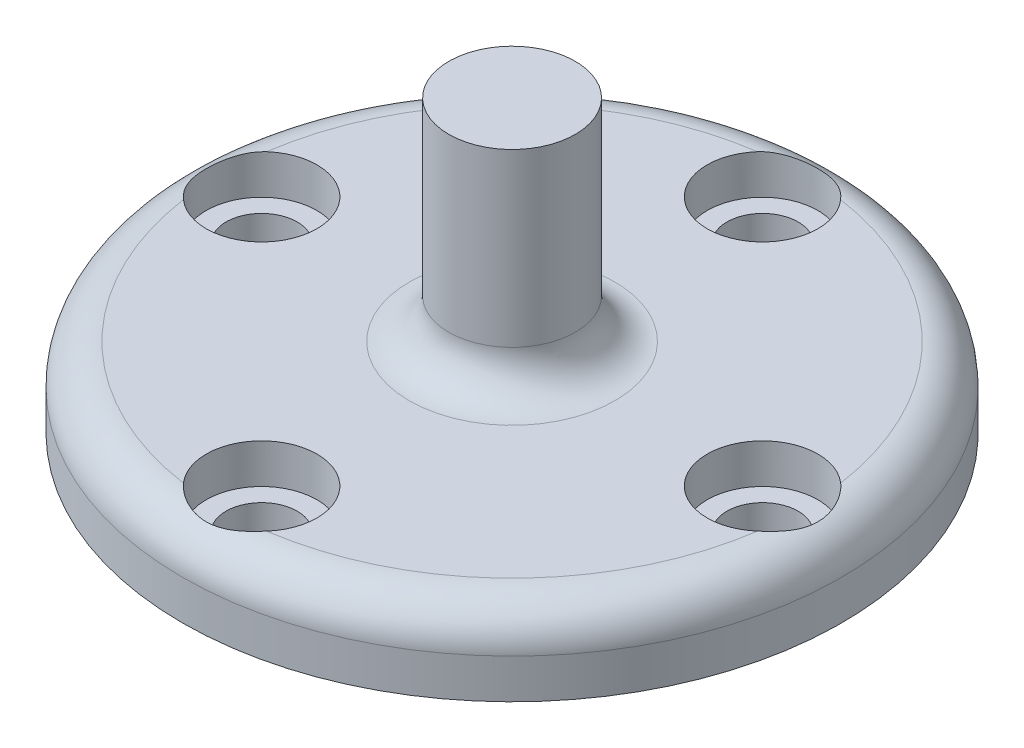
ISO-10303-21;
HEADER;
FILE_DESCRIPTION(('STEP AP214'),'2;1');
FILE_NAME('part.step','',(''),(''),'','','');
FILE_SCHEMA(('AUTOMOTIVE_DESIGN { 1 0 10303 214 1 1 1 1 }'));
ENDSEC;
DATA;
#1=APPLICATION_CONTEXT('core data for automotive mechanical design processes');
#2=APPLICATION_PROTOCOL_DEFINITION('international standard','automotive_design',2000,#1);
#3=PRODUCT_CONTEXT('',#1,'mechanical');
#4=PRODUCT('Part','Part','',(#3));
#5=PRODUCT_RELATED_PRODUCT_CATEGORY('part','',(#4));
#6=PRODUCT_DEFINITION_FORMATION('','',#4);
#7=PRODUCT_DEFINITION_CONTEXT('part definition',#1,'design');
#8=PRODUCT_DEFINITION('design','',#6,#7);
#9=PRODUCT_DEFINITION_SHAPE('','',#8);
#10=(LENGTH_UNIT() NAMED_UNIT(*) SI_UNIT(.MILLI.,.METRE.));
#11=(NAMED_UNIT(*) PLANE_ANGLE_UNIT() SI_UNIT($,.RADIAN.));
#12=(NAMED_UNIT(*) SI_UNIT($,.STERADIAN.) SOLID_ANGLE_UNIT());
#13=UNCERTAINTY_MEASURE_WITH_UNIT(LENGTH_MEASURE(1.E-05),#10,'distance_accuracy_value','');
#14=(GEOMETRIC_REPRESENTATION_CONTEXT(3) GLOBAL_UNCERTAINTY_ASSIGNED_CONTEXT((#13)) GLOBAL_UNIT_ASSIGNED_CONTEXT((#10,
#11,#12)) REPRESENTATION_CONTEXT('',''));
#15=CARTESIAN_POINT('',(0.,0.,0.));
#16=DIRECTION('',(0.,0.,1.));
#17=DIRECTION('',(1.,0.,0.));
#18=AXIS2_PLACEMENT_3D('',#15,#16,#17);
#19=CARTESIAN_POINT('',(0.,0.,-9.5));
#20=DIRECTION('',(0.,1.,0.));
#21=DIRECTION('',(0.,0.,1.));
#22=AXIS2_PLACEMENT_3D('',#19,#20,#21);
#23=CYLINDRICAL_SURFACE('',#22,1.35);
#24=CARTESIAN_POINT('',(0.,0.,-9.5));
#25=DIRECTION('',(0.,1.,0.));
#26=DIRECTION('',(0.,0.,1.));
#27=AXIS2_PLACEMENT_3D('',#24,#25,#26);
#28=CIRCLE('',#27,1.35);
#29=CARTESIAN_POINT('',(0.,0.,-8.15));
#30=VERTEX_POINT('',#29);
#31=EDGE_CURVE('E201',#30,#30,#28,.T.);
#32=ORIENTED_EDGE('',*,*,#31,.F.);
#33=EDGE_LOOP('',(#32));
#34=FACE_BOUND('',#33,.T.);
#35=CARTESIAN_POINT('',(0.,1.5,-9.5));
#36=DIRECTION('',(0.,1.,0.));
#37=DIRECTION('',(0.,0.,1.));
#38=AXIS2_PLACEMENT_3D('',#35,#36,#37);
#39=CIRCLE('',#38,1.35);
#40=CARTESIAN_POINT('',(0.,1.5,-8.15));
#41=VERTEX_POINT('',#40);
#42=EDGE_CURVE('E210',#41,#41,#39,.F.);
#43=ORIENTED_EDGE('',*,*,#42,.F.);
#44=EDGE_LOOP('',(#43));
#45=FACE_BOUND('',#44,.T.);
#46=ADVANCED_FACE('F43',(#34,#45),#23,.F.);
#47=CARTESIAN_POINT('',(0.,3.,0.));
#48=DIRECTION('',(0.,-1.,0.));
#49=DIRECTION('',(0.,0.,-1.));
#50=AXIS2_PLACEMENT_3D('',#47,#48,#49);
#51=CYLINDRICAL_SURFACE('',#50,12.5);
#52=CARTESIAN_POINT('',(0.,1.5,0.));
#53=DIRECTION('',(0.,1.,0.));
#54=DIRECTION('',(0.,0.,1.));
#55=AXIS2_PLACEMENT_3D('',#52,#53,#54);
#56=CIRCLE('',#55,12.5);
#57=CARTESIAN_POINT('',(0.,1.5,12.5));
#58=VERTEX_POINT('',#57);
#59=EDGE_CURVE('E52',#58,#58,#56,.F.);
#60=ORIENTED_EDGE('',*,*,#59,.T.);
#61=EDGE_LOOP('',(#60));
#62=FACE_BOUND('',#61,.T.);
#63=CARTESIAN_POINT('',(0.,0.,0.));
#64=DIRECTION('',(0.,1.,0.));
#65=DIRECTION('',(0.,0.,1.));
#66=AXIS2_PLACEMENT_3D('',#63,#64,#65);
#67=CIRCLE('',#66,12.5);
#68=CARTESIAN_POINT('',(0.,0.,12.5));
#69=VERTEX_POINT('',#68);
#70=EDGE_CURVE('E198',#69,#69,#67,.T.);
#71=ORIENTED_EDGE('',*,*,#70,.T.);
#72=EDGE_LOOP('',(#71));
#73=FACE_BOUND('',#72,.T.);
#74=ADVANCED_FACE('F182',(#62,#73),#51,.T.);
#75=CARTESIAN_POINT('',(0.,3.,0.));
#76=DIRECTION('',(0.,1.,0.));
#77=DIRECTION('',(0.,0.,1.));
#78=AXIS2_PLACEMENT_3D('',#75,#76,#77);
#79=PLANE('',#78);
#80=CARTESIAN_POINT('',(0.,3.,0.));
#81=DIRECTION('',(0.,1.,0.));
#82=DIRECTION('',(0.,0.,1.));
#83=AXIS2_PLACEMENT_3D('',#80,#81,#82);
#84=CIRCLE('',#83,3.9);
#85=CARTESIAN_POINT('',(0.,3.,3.9));
#86=VERTEX_POINT('',#85);
#87=EDGE_CURVE('E96',#86,#86,#84,.F.);
#88=ORIENTED_EDGE('',*,*,#87,.T.);
#89=EDGE_LOOP('',(#88));
#90=FACE_BOUND('',#89,.T.);
#91=CARTESIAN_POINT('',(9.5,3.,0.));
#92=DIRECTION('',(0.,1.,0.));
#93=DIRECTION('',(-1.,0.,0.));
#94=AXIS2_PLACEMENT_3D('',#91,#92,#93);
#95=CIRCLE('',#94,2.1);
#96=CARTESIAN_POINT('',(10.8863157894737,3.,-1.57738027496727));
#97=VERTEX_POINT('',#96);
#98=CARTESIAN_POINT('',(10.8863157894737,3.,1.57738027496735));
#99=VERTEX_POINT('',#98);
#100=EDGE_CURVE('E89',#97,#99,#95,.T.);
#101=ORIENTED_EDGE('',*,*,#100,.F.);
#102=CARTESIAN_POINT('',(0.,3.,0.));
#103=DIRECTION('',(0.,1.,0.));
#104=DIRECTION('',(0.,0.,1.));
#105=AXIS2_PLACEMENT_3D('',#102,#103,#104);
#106=CIRCLE('',#105,11.);
#107=CARTESIAN_POINT('',(1.57738027496731,3.,-10.8863157894737));
#108=VERTEX_POINT('',#107);
#109=EDGE_CURVE('E106',#97,#108,#106,.T.);
#110=ORIENTED_EDGE('',*,*,#109,.T.);
#111=CARTESIAN_POINT('',(0.,3.,-9.5));
#112=DIRECTION('',(0.,1.,0.));
#113=DIRECTION('',(0.,0.,1.));
#114=AXIS2_PLACEMENT_3D('',#111,#112,#113);
#115=CIRCLE('',#114,2.1);
#116=CARTESIAN_POINT('',(-1.57738027496731,3.,-10.8863157894737));
#117=VERTEX_POINT('',#116);
#118=EDGE_CURVE('E224',#117,#108,#115,.T.);
#119=ORIENTED_EDGE('',*,*,#118,.F.);
#120=CARTESIAN_POINT('',(0.,3.,0.));
#121=DIRECTION('',(0.,1.,0.));
#122=DIRECTION('',(0.,0.,1.));
#123=AXIS2_PLACEMENT_3D('',#120,#121,#122);
#124=CIRCLE('',#123,11.);
#125=CARTESIAN_POINT('',(-10.8863157894737,3.,-1.57738027496743));
#126=VERTEX_POINT('',#125);
#127=EDGE_CURVE('E219',#117,#126,#124,.T.);
#128=ORIENTED_EDGE('',*,*,#127,.T.);
#129=CARTESIAN_POINT('',(-9.5,3.,0.));
#130=DIRECTION('',(0.,1.,0.));
#131=DIRECTION('',(1.,0.,0.));
#132=AXIS2_PLACEMENT_3D('',#129,#130,#131);
#133=CIRCLE('',#132,2.1);
#134=CARTESIAN_POINT('',(-10.8863157894737,3.,1.5773802749672));
#135=VERTEX_POINT('',#134);
#136=EDGE_CURVE('E256',#135,#126,#133,.T.);
#137=ORIENTED_EDGE('',*,*,#136,.F.);
#138=CARTESIAN_POINT('',(0.,3.,0.));
#139=DIRECTION('',(0.,1.,0.));
#140=DIRECTION('',(0.,0.,1.));
#141=AXIS2_PLACEMENT_3D('',#138,#139,#140);
#142=CIRCLE('',#141,11.);
#143=CARTESIAN_POINT('',(-1.57738027496731,3.,10.8863157894737));
#144=VERTEX_POINT('',#143);
#145=EDGE_CURVE('E95',#135,#144,#142,.T.);
#146=ORIENTED_EDGE('',*,*,#145,.T.);
#147=CARTESIAN_POINT('',(0.,3.,9.5));
#148=DIRECTION('',(0.,1.,0.));
#149=DIRECTION('',(0.,0.,-1.));
#150=AXIS2_PLACEMENT_3D('',#147,#148,#149);
#151=CIRCLE('',#150,2.1);
#152=CARTESIAN_POINT('',(1.57738027496731,3.,10.8863157894737));
#153=VERTEX_POINT('',#152);
#154=EDGE_CURVE('E91',#153,#144,#151,.T.);
#155=ORIENTED_EDGE('',*,*,#154,.F.);
#156=CARTESIAN_POINT('',(0.,3.,0.));
#157=DIRECTION('',(0.,1.,0.));
#158=DIRECTION('',(0.,0.,1.));
#159=AXIS2_PLACEMENT_3D('',#156,#157,#158);
#160=CIRCLE('',#159,11.);
#161=EDGE_CURVE('E86',#153,#99,#160,.T.);
#162=ORIENTED_EDGE('',*,*,#161,.T.);
#163=EDGE_LOOP('',(#101,#110,#119,#128,#137,#146,#155,#162));
#164=FACE_BOUND('',#163,.T.);
#165=ADVANCED_FACE('F88',(#90,#164),#79,.T.);
#166=CARTESIAN_POINT('',(0.,0.,0.));
#167=DIRECTION('',(0.,1.,0.));
#168=DIRECTION('',(0.,0.,1.));
#169=AXIS2_PLACEMENT_3D('',#166,#167,#168);
#170=PLANE('',#169);
#171=CARTESIAN_POINT('',(9.5,0.,0.));
#172=DIRECTION('',(0.,1.,0.));
#173=DIRECTION('',(-1.,0.,0.));
#174=AXIS2_PLACEMENT_3D('',#171,#172,#173);
#175=CIRCLE('',#174,1.35);
#176=CARTESIAN_POINT('',(8.15,0.,0.));
#177=VERTEX_POINT('',#176);
#178=EDGE_CURVE('E226',#177,#177,#175,.T.);
#179=ORIENTED_EDGE('',*,*,#178,.T.);
#180=EDGE_LOOP('',(#179));
#181=FACE_BOUND('',#180,.T.);
#182=CARTESIAN_POINT('',(0.,0.,9.5));
#183=DIRECTION('',(0.,1.,0.));
#184=DIRECTION('',(0.,0.,-1.));
#185=AXIS2_PLACEMENT_3D('',#182,#183,#184);
#186=CIRCLE('',#185,1.35);
#187=CARTESIAN_POINT('',(0.,0.,8.15));
#188=VERTEX_POINT('',#187);
#189=EDGE_CURVE('E232',#188,#188,#186,.T.);
#190=ORIENTED_EDGE('',*,*,#189,.T.);
#191=EDGE_LOOP('',(#190));
#192=FACE_BOUND('',#191,.T.);
#193=CARTESIAN_POINT('',(-9.5,0.,0.));
#194=DIRECTION('',(0.,1.,0.));
#195=DIRECTION('',(1.,0.,0.));
#196=AXIS2_PLACEMENT_3D('',#193,#194,#195);
#197=CIRCLE('',#196,1.35);
#198=CARTESIAN_POINT('',(-8.15,0.,0.));
#199=VERTEX_POINT('',#198);
#200=EDGE_CURVE('E235',#199,#199,#197,.T.);
#201=ORIENTED_EDGE('',*,*,#200,.T.);
#202=EDGE_LOOP('',(#201));
#203=FACE_BOUND('',#202,.T.);
#204=ORIENTED_EDGE('',*,*,#31,.T.);
#205=EDGE_LOOP('',(#204));
#206=FACE_BOUND('',#205,.T.);
#207=ORIENTED_EDGE('',*,*,#70,.F.);
#208=EDGE_LOOP('',(#207));
#209=FACE_BOUND('',#208,.T.);
#210=ADVANCED_FACE('F186',(#181,#192,#203,#206,#209),#170,.F.);
#211=CARTESIAN_POINT('',(0.,1.5,-9.5));
#212=DIRECTION('',(0.,1.,0.));
#213=DIRECTION('',(0.,0.,1.));
#214=AXIS2_PLACEMENT_3D('',#211,#212,#213);
#215=PLANE('',#214);
#216=CARTESIAN_POINT('',(0.,1.5,-9.5));
#217=DIRECTION('',(0.,1.,0.));
#218=DIRECTION('',(0.,0.,1.));
#219=AXIS2_PLACEMENT_3D('',#216,#217,#218);
#220=CIRCLE('',#219,2.1);
#221=CARTESIAN_POINT('',(0.,1.5,-7.4));
#222=VERTEX_POINT('',#221);
#223=EDGE_CURVE('E216',#222,#222,#220,.T.);
#224=ORIENTED_EDGE('',*,*,#223,.T.);
#225=EDGE_LOOP('',(#224));
#226=FACE_BOUND('',#225,.T.);
#227=ORIENTED_EDGE('',*,*,#42,.T.);
#228=EDGE_LOOP('',(#227));
#229=FACE_BOUND('',#228,.T.);
#230=ADVANCED_FACE('F177',(#226,#229),#215,.T.);
#231=CARTESIAN_POINT('',(0.,1.5,-9.5));
#232=DIRECTION('',(0.,1.,0.));
#233=DIRECTION('',(0.,0.,1.));
#234=AXIS2_PLACEMENT_3D('',#231,#232,#233);
#235=CYLINDRICAL_SURFACE('',#234,2.1);
#236=ORIENTED_EDGE('',*,*,#223,.F.);
#237=EDGE_LOOP('',(#236));
#238=FACE_BOUND('',#237,.T.);
#239=ORIENTED_EDGE('',*,*,#118,.T.);
#240=CARTESIAN_POINT('',(1.57738027496731,3.,-10.8863157894737));
#241=CARTESIAN_POINT('',(1.5349891041414,2.99998857657452,-10.9345653348639));
#242=CARTESIAN_POINT('',(1.49039993461807,2.99826453872729,-10.9808213903737));
#243=CARTESIAN_POINT('',(1.39731034725975,2.99227485033015,-11.0689539051379));
#244=CARTESIAN_POINT('',(1.348813517057,2.9880115086396,-11.1108343023446));
#245=CARTESIAN_POINT('',(1.24839801387459,2.97783204704433,-11.1898462735401));
#246=CARTESIAN_POINT('',(1.196485142123,2.97191867660506,-11.2269855988685));
#247=CARTESIAN_POINT('',(1.08958513213709,2.95922649919493,-11.2963484332717));
#248=CARTESIAN_POINT('',(1.03459761760926,2.9524475861628,-11.3285713388377));
#249=CARTESIAN_POINT('',(0.878692009023795,2.93351622935145,-11.4106386218583));
#250=CARTESIAN_POINT('',(0.774867187980858,2.92122677816197,-11.4550642518468));
#251=CARTESIAN_POINT('',(0.561231662710039,2.89982550793822,-11.5267493873391));
#252=CARTESIAN_POINT('',(0.451424674417548,2.89071174171478,-11.554019420186));
#253=CARTESIAN_POINT('',(0.224102357027013,2.87796479914777,-11.5913009973022));
#254=CARTESIAN_POINT('',(0.106453598222821,2.87456049017974,-11.6005940304726));
#255=CARTESIAN_POINT('',(-0.12872752924703,2.87500603704746,-11.5993469062552));
#256=CARTESIAN_POINT('',(-0.246259894930211,2.87885607419162,-11.5888062531625));
#257=CARTESIAN_POINT('',(-0.471764062141029,2.89226071158382,-11.5493664572928));
#258=CARTESIAN_POINT('',(-0.579920949483285,2.90152298161669,-11.5214035473141));
#259=CARTESIAN_POINT('',(-0.790260741589626,2.92297520829711,-11.4488108207754));
#260=CARTESIAN_POINT('',(-0.892440887149015,2.93516650409049,-11.4041733754506));
#261=CARTESIAN_POINT('',(-1.04555654563005,2.9537920690025,-11.3222874329257));
#262=CARTESIAN_POINT('',(-1.0993710411016,2.96041378279082,-11.2903357309091));
#263=CARTESIAN_POINT('',(-1.20401363385988,2.97278246656713,-11.2217034260519));
#264=CARTESIAN_POINT('',(-1.25484210705593,2.97852954680793,-11.1850234203209));
#265=CARTESIAN_POINT('',(-1.35320163381201,2.98840674782049,-11.1071047435153));
#266=CARTESIAN_POINT('',(-1.40072676949992,2.99253402521057,-11.0658582176576));
#267=CARTESIAN_POINT('',(-1.49200364144476,2.99832643888071,-10.9791558697687));
#268=CARTESIAN_POINT('',(-1.53575200468445,2.99998939527897,-10.9336963587447));
#269=CARTESIAN_POINT('',(-1.57738027496731,3.00000000000001,-10.8863157894737));
#270=B_SPLINE_CURVE_WITH_KNOTS('',3,(#240,#241,#242,#243,#244,#245,#246,#247,#248,#249,#250,
#251,#252,#253,#254,#255,#256,#257,#258,#259,#260,#261,#262,#263,#264,#265,#266,#267,#268,#269),
.UNSPECIFIED.,.F.,.F.,(4,2,2,2,2,2,2,2,2,2,2,2,2,2,4),(0.,0.19252195179426,0.38486911986169,
0.57689767179495,0.768949777012993,1.1081731375737,1.44718813389067,1.79949381359815,
2.15180829862504,2.4866530688013,2.82165122177021,3.01024038194402,3.1988057495926,
3.387700657661,3.57676255829637),.UNSPECIFIED.);
#271=EDGE_CURVE('E58',#108,#117,#270,.T.);
#272=ORIENTED_EDGE('',*,*,#271,.T.);
#273=EDGE_LOOP('',(#239,#272));
#274=FACE_BOUND('',#273,.T.);
#275=ADVANCED_FACE('F171',(#238,#274),#235,.F.);
#276=CARTESIAN_POINT('',(-9.5,0.,0.));
#277=DIRECTION('',(0.,1.,0.));
#278=DIRECTION('',(1.,0.,0.));
#279=AXIS2_PLACEMENT_3D('',#276,#277,#278);
#280=CYLINDRICAL_SURFACE('',#279,1.35);
#281=ORIENTED_EDGE('',*,*,#200,.F.);
#282=EDGE_LOOP('',(#281));
#283=FACE_BOUND('',#282,.T.);
#284=CARTESIAN_POINT('',(-9.5,1.5,0.));
#285=DIRECTION('',(0.,1.,0.));
#286=DIRECTION('',(0.,0.,1.));
#287=AXIS2_PLACEMENT_3D('',#284,#285,#286);
#288=CIRCLE('',#287,1.35);
#289=CARTESIAN_POINT('',(-9.5,1.5,1.3499999999999));
#290=VERTEX_POINT('',#289);
#291=EDGE_CURVE('E239',#290,#290,#288,.F.);
#292=ORIENTED_EDGE('',*,*,#291,.F.);
#293=EDGE_LOOP('',(#292));
#294=FACE_BOUND('',#293,.T.);
#295=ADVANCED_FACE('F176',(#283,#294),#280,.F.);
#296=CARTESIAN_POINT('',(0.,0.,9.5));
#297=DIRECTION('',(0.,1.,0.));
#298=DIRECTION('',(0.,0.,-1.));
#299=AXIS2_PLACEMENT_3D('',#296,#297,#298);
#300=CYLINDRICAL_SURFACE('',#299,1.35);
#301=ORIENTED_EDGE('',*,*,#189,.F.);
#302=EDGE_LOOP('',(#301));
#303=FACE_BOUND('',#302,.T.);
#304=CARTESIAN_POINT('',(0.,1.5,9.5));
#305=DIRECTION('',(0.,1.,0.));
#306=DIRECTION('',(0.,0.,1.));
#307=AXIS2_PLACEMENT_3D('',#304,#305,#306);
#308=CIRCLE('',#307,1.35);
#309=CARTESIAN_POINT('',(0.,1.5,10.85));
#310=VERTEX_POINT('',#309);
#311=EDGE_CURVE('E246',#310,#310,#308,.F.);
#312=ORIENTED_EDGE('',*,*,#311,.F.);
#313=EDGE_LOOP('',(#312));
#314=FACE_BOUND('',#313,.T.);
#315=ADVANCED_FACE('F335',(#303,#314),#300,.F.);
#316=CARTESIAN_POINT('',(9.5,0.,0.));
#317=DIRECTION('',(0.,1.,0.));
#318=DIRECTION('',(-1.,0.,0.));
#319=AXIS2_PLACEMENT_3D('',#316,#317,#318);
#320=CYLINDRICAL_SURFACE('',#319,1.35);
#321=ORIENTED_EDGE('',*,*,#178,.F.);
#322=EDGE_LOOP('',(#321));
#323=FACE_BOUND('',#322,.T.);
#324=CARTESIAN_POINT('',(9.5,1.5,0.));
#325=DIRECTION('',(0.,1.,0.));
#326=DIRECTION('',(0.,0.,1.));
#327=AXIS2_PLACEMENT_3D('',#324,#325,#326);
#328=CIRCLE('',#327,1.35);
#329=CARTESIAN_POINT('',(9.5,1.5,1.35000000000003));
#330=VERTEX_POINT('',#329);
#331=EDGE_CURVE('E249',#330,#330,#328,.F.);
#332=ORIENTED_EDGE('',*,*,#331,.F.);
#333=EDGE_LOOP('',(#332));
#334=FACE_BOUND('',#333,.T.);
#335=ADVANCED_FACE('F140',(#323,#334),#320,.F.);
#336=CARTESIAN_POINT('',(9.5,1.5,0.));
#337=DIRECTION('',(0.,1.,0.));
#338=DIRECTION('',(-1.,0.,0.));
#339=AXIS2_PLACEMENT_3D('',#336,#337,#338);
#340=PLANE('',#339);
#341=CARTESIAN_POINT('',(9.5,1.5,0.));
#342=DIRECTION('',(0.,1.,0.));
#343=DIRECTION('',(-1.,0.,0.));
#344=AXIS2_PLACEMENT_3D('',#341,#342,#343);
#345=CIRCLE('',#344,2.1);
#346=CARTESIAN_POINT('',(7.4,1.5,0.));
#347=VERTEX_POINT('',#346);
#348=EDGE_CURVE('E102',#347,#347,#345,.T.);
#349=ORIENTED_EDGE('',*,*,#348,.T.);
#350=EDGE_LOOP('',(#349));
#351=FACE_BOUND('',#350,.T.);
#352=ORIENTED_EDGE('',*,*,#331,.T.);
#353=EDGE_LOOP('',(#352));
#354=FACE_BOUND('',#353,.T.);
#355=ADVANCED_FACE('F135',(#351,#354),#340,.T.);
#356=CARTESIAN_POINT('',(9.5,1.5,0.));
#357=DIRECTION('',(0.,1.,0.));
#358=DIRECTION('',(-1.,0.,0.));
#359=AXIS2_PLACEMENT_3D('',#356,#357,#358);
#360=CYLINDRICAL_SURFACE('',#359,2.1);
#361=ORIENTED_EDGE('',*,*,#348,.F.);
#362=EDGE_LOOP('',(#361));
#363=FACE_BOUND('',#362,.T.);
#364=ORIENTED_EDGE('',*,*,#100,.T.);
#365=CARTESIAN_POINT('',(10.8863157894737,3.,1.57738027496735));
#366=CARTESIAN_POINT('',(10.9345653348639,2.99998857657452,1.53498910414144));
#367=CARTESIAN_POINT('',(10.9808213903737,2.99826453872729,1.49039993461811));
#368=CARTESIAN_POINT('',(11.0689539051379,2.99227485033015,1.39731034725979));
#369=CARTESIAN_POINT('',(11.1108343023446,2.9880115086396,1.34881351705703));
#370=CARTESIAN_POINT('',(11.1898462735401,2.97783204704433,1.24839801387463));
#371=CARTESIAN_POINT('',(11.2269855988685,2.97191867660506,1.19648514212304));
#372=CARTESIAN_POINT('',(11.2963484332717,2.95922649919493,1.08958513213713));
#373=CARTESIAN_POINT('',(11.3285713388377,2.9524475861628,1.0345976176093));
#374=CARTESIAN_POINT('',(11.4106386218583,2.93351622935145,0.878692009023835));
#375=CARTESIAN_POINT('',(11.4550642518468,2.92122677816197,0.774867187980898));
#376=CARTESIAN_POINT('',(11.5267493873391,2.89982550793822,0.56123166271008));
#377=CARTESIAN_POINT('',(11.554019420186,2.89071174171479,0.451424674417589));
#378=CARTESIAN_POINT('',(11.5913009973022,2.87796479914777,0.224102357027054));
#379=CARTESIAN_POINT('',(11.6005940304726,2.87456049017974,0.106453598222862));
#380=CARTESIAN_POINT('',(11.5993469062552,2.87500603704746,-0.12872752924699));
#381=CARTESIAN_POINT('',(11.5888062531625,2.87885607419162,-0.246259894930171));
#382=CARTESIAN_POINT('',(11.5493664572928,2.89226071158382,-0.471764062140989));
#383=CARTESIAN_POINT('',(11.5214035473141,2.90152298161669,-0.579920949483245));
#384=CARTESIAN_POINT('',(11.4488108207754,2.92297520829711,-0.790260741589586));
#385=CARTESIAN_POINT('',(11.4041733754506,2.93516650409049,-0.892440887148974));
#386=CARTESIAN_POINT('',(11.3222874329257,2.9537920690025,-1.04555654563001));
#387=CARTESIAN_POINT('',(11.2903357309091,2.96041378279082,-1.09937104110156));
#388=CARTESIAN_POINT('',(11.2217034260519,2.97278246656713,-1.20401363385984));
#389=CARTESIAN_POINT('',(11.1850234203209,2.97852954680793,-1.25484210705589));
#390=CARTESIAN_POINT('',(11.1071047435153,2.98840674782049,-1.35320163381197));
#391=CARTESIAN_POINT('',(11.0658582176576,2.99253402521057,-1.40072676949988));
#392=CARTESIAN_POINT('',(10.9791558697687,2.99832643888071,-1.49200364144472));
#393=CARTESIAN_POINT('',(10.9336963587447,2.99998939527897,-1.53575200468441));
#394=CARTESIAN_POINT('',(10.8863157894737,3.00000000000001,-1.57738027496727));
#395=B_SPLINE_CURVE_WITH_KNOTS('',3,(#365,#366,#367,#368,#369,#370,#371,#372,#373,#374,#375,
#376,#377,#378,#379,#380,#381,#382,#383,#384,#385,#386,#387,#388,#389,#390,#391,#392,#393,#394),
.UNSPECIFIED.,.F.,.F.,(4,2,2,2,2,2,2,2,2,2,2,2,2,2,4),(0.,0.192521951794259,0.384869119861689,
0.576897671794947,0.768949777012992,1.1081731375737,1.44718813389067,1.79949381359815,
2.15180829862504,2.4866530688013,2.82165122177021,3.01024038194402,3.1988057495926,
3.38770065766099,3.57676255829637),.UNSPECIFIED.);
#396=EDGE_CURVE('E100',#99,#97,#395,.T.);
#397=ORIENTED_EDGE('',*,*,#396,.T.);
#398=EDGE_LOOP('',(#364,#397));
#399=FACE_BOUND('',#398,.T.);
#400=ADVANCED_FACE('F99',(#363,#399),#360,.F.);
#401=CARTESIAN_POINT('',(0.,1.5,9.5));
#402=DIRECTION('',(0.,1.,0.));
#403=DIRECTION('',(0.,0.,-1.));
#404=AXIS2_PLACEMENT_3D('',#401,#402,#403);
#405=PLANE('',#404);
#406=CARTESIAN_POINT('',(0.,1.5,9.5));
#407=DIRECTION('',(0.,1.,0.));
#408=DIRECTION('',(0.,0.,-1.));
#409=AXIS2_PLACEMENT_3D('',#406,#407,#408);
#410=CIRCLE('',#409,2.1);
#411=CARTESIAN_POINT('',(0.,1.5,7.4));
#412=VERTEX_POINT('',#411);
#413=EDGE_CURVE('E103',#412,#412,#410,.T.);
#414=ORIENTED_EDGE('',*,*,#413,.T.);
#415=EDGE_LOOP('',(#414));
#416=FACE_BOUND('',#415,.T.);
#417=ORIENTED_EDGE('',*,*,#311,.T.);
#418=EDGE_LOOP('',(#417));
#419=FACE_BOUND('',#418,.T.);
#420=ADVANCED_FACE('F134',(#416,#419),#405,.T.);
#421=CARTESIAN_POINT('',(0.,1.5,9.5));
#422=DIRECTION('',(0.,1.,0.));
#423=DIRECTION('',(0.,0.,-1.));
#424=AXIS2_PLACEMENT_3D('',#421,#422,#423);
#425=CYLINDRICAL_SURFACE('',#424,2.1);
#426=ORIENTED_EDGE('',*,*,#413,.F.);
#427=EDGE_LOOP('',(#426));
#428=FACE_BOUND('',#427,.T.);
#429=ORIENTED_EDGE('',*,*,#154,.T.);
#430=CARTESIAN_POINT('',(-1.57738027496731,3.,10.8863157894737));
#431=CARTESIAN_POINT('',(-1.5349891041414,2.99998857657452,10.9345653348639));
#432=CARTESIAN_POINT('',(-1.49039993461807,2.99826453872729,10.9808213903737));
#433=CARTESIAN_POINT('',(-1.39731034725975,2.99227485033015,11.0689539051379));
#434=CARTESIAN_POINT('',(-1.348813517057,2.9880115086396,11.1108343023446));
#435=CARTESIAN_POINT('',(-1.24839801387459,2.97783204704433,11.1898462735401));
#436=CARTESIAN_POINT('',(-1.196485142123,2.97191867660506,11.2269855988685));
#437=CARTESIAN_POINT('',(-1.08958513213709,2.95922649919493,11.2963484332717));
#438=CARTESIAN_POINT('',(-1.03459761760926,2.9524475861628,11.3285713388377));
#439=CARTESIAN_POINT('',(-0.878692009023795,2.93351622935145,11.4106386218583));
#440=CARTESIAN_POINT('',(-0.774867187980858,2.92122677816197,11.4550642518468));
#441=CARTESIAN_POINT('',(-0.561231662710039,2.89982550793822,11.5267493873391));
#442=CARTESIAN_POINT('',(-0.451424674417548,2.89071174171478,11.554019420186));
#443=CARTESIAN_POINT('',(-0.224102357027013,2.87796479914777,11.5913009973022));
#444=CARTESIAN_POINT('',(-0.106453598222821,2.87456049017974,11.6005940304726));
#445=CARTESIAN_POINT('',(0.12872752924703,2.87500603704746,11.5993469062552));
#446=CARTESIAN_POINT('',(0.246259894930211,2.87885607419162,11.5888062531625));
#447=CARTESIAN_POINT('',(0.471764062141029,2.89226071158382,11.5493664572928));
#448=CARTESIAN_POINT('',(0.579920949483285,2.90152298161669,11.5214035473141));
#449=CARTESIAN_POINT('',(0.790260741589626,2.92297520829711,11.4488108207754));
#450=CARTESIAN_POINT('',(0.892440887149015,2.93516650409049,11.4041733754506));
#451=CARTESIAN_POINT('',(1.04555654563005,2.9537920690025,11.3222874329257));
#452=CARTESIAN_POINT('',(1.0993710411016,2.96041378279082,11.2903357309091));
#453=CARTESIAN_POINT('',(1.20401363385988,2.97278246656713,11.2217034260519));
#454=CARTESIAN_POINT('',(1.25484210705593,2.97852954680793,11.1850234203209));
#455=CARTESIAN_POINT('',(1.35320163381201,2.98840674782049,11.1071047435153));
#456=CARTESIAN_POINT('',(1.40072676949992,2.99253402521057,11.0658582176576));
#457=CARTESIAN_POINT('',(1.49200364144476,2.99832643888071,10.9791558697687));
#458=CARTESIAN_POINT('',(1.53575200468445,2.99998939527897,10.9336963587447));
#459=CARTESIAN_POINT('',(1.57738027496731,3.00000000000001,10.8863157894737));
#460=B_SPLINE_CURVE_WITH_KNOTS('',3,(#430,#431,#432,#433,#434,#435,#436,#437,#438,#439,#440,
#441,#442,#443,#444,#445,#446,#447,#448,#449,#450,#451,#452,#453,#454,#455,#456,#457,#458,#459),
.UNSPECIFIED.,.F.,.F.,(4,2,2,2,2,2,2,2,2,2,2,2,2,2,4),(0.,0.19252195179426,0.38486911986169,
0.57689767179495,0.768949777012993,1.1081731375737,1.44718813389067,1.79949381359815,
2.15180829862504,2.4866530688013,2.82165122177021,3.01024038194402,3.1988057495926,
3.387700657661,3.57676255829637),.UNSPECIFIED.);
#461=EDGE_CURVE('E108',#144,#153,#460,.T.);
#462=ORIENTED_EDGE('',*,*,#461,.T.);
#463=EDGE_LOOP('',(#429,#462));
#464=FACE_BOUND('',#463,.T.);
#465=ADVANCED_FACE('F142',(#428,#464),#425,.F.);
#466=CARTESIAN_POINT('',(-9.5,1.5,0.));
#467=DIRECTION('',(0.,1.,0.));
#468=DIRECTION('',(1.,0.,0.));
#469=AXIS2_PLACEMENT_3D('',#466,#467,#468);
#470=PLANE('',#469);
#471=CARTESIAN_POINT('',(-9.5,1.5,0.));
#472=DIRECTION('',(0.,1.,0.));
#473=DIRECTION('',(1.,0.,0.));
#474=AXIS2_PLACEMENT_3D('',#471,#472,#473);
#475=CIRCLE('',#474,2.1);
#476=CARTESIAN_POINT('',(-7.4,1.5,0.));
#477=VERTEX_POINT('',#476);
#478=EDGE_CURVE('E252',#477,#477,#475,.T.);
#479=ORIENTED_EDGE('',*,*,#478,.T.);
#480=EDGE_LOOP('',(#479));
#481=FACE_BOUND('',#480,.T.);
#482=ORIENTED_EDGE('',*,*,#291,.T.);
#483=EDGE_LOOP('',(#482));
#484=FACE_BOUND('',#483,.T.);
#485=ADVANCED_FACE('F146',(#481,#484),#470,.T.);
#486=CARTESIAN_POINT('',(-9.5,1.5,0.));
#487=DIRECTION('',(0.,1.,0.));
#488=DIRECTION('',(1.,0.,0.));
#489=AXIS2_PLACEMENT_3D('',#486,#487,#488);
#490=CYLINDRICAL_SURFACE('',#489,2.1);
#491=ORIENTED_EDGE('',*,*,#478,.F.);
#492=EDGE_LOOP('',(#491));
#493=FACE_BOUND('',#492,.T.);
#494=ORIENTED_EDGE('',*,*,#136,.T.);
#495=CARTESIAN_POINT('',(-10.8863157894737,3.,-1.57738027496743));
#496=CARTESIAN_POINT('',(-10.9345653348639,2.99998857657452,-1.53498910414152));
#497=CARTESIAN_POINT('',(-10.9808213903737,2.99826453872729,-1.49039993461819));
#498=CARTESIAN_POINT('',(-11.0689539051379,2.99227485033015,-1.39731034725987));
#499=CARTESIAN_POINT('',(-11.1108343023446,2.9880115086396,-1.34881351705711));
#500=CARTESIAN_POINT('',(-11.1898462735401,2.97783204704433,-1.24839801387471));
#501=CARTESIAN_POINT('',(-11.2269855988685,2.97191867660506,-1.19648514212312));
#502=CARTESIAN_POINT('',(-11.2963484332717,2.95922649919493,-1.08958513213721));
#503=CARTESIAN_POINT('',(-11.3285713388377,2.9524475861628,-1.03459761760938));
#504=CARTESIAN_POINT('',(-11.4106386218583,2.93351622935145,-0.878692009023915));
#505=CARTESIAN_POINT('',(-11.4550642518468,2.92122677816197,-0.774867187980979));
#506=CARTESIAN_POINT('',(-11.5267493873391,2.89982550793822,-0.561231662710161));
#507=CARTESIAN_POINT('',(-11.554019420186,2.89071174171479,-0.451424674417671));
#508=CARTESIAN_POINT('',(-11.5913009973022,2.87796479914777,-0.224102357027137));
#509=CARTESIAN_POINT('',(-11.6005940304726,2.87456049017974,-0.106453598222945));
#510=CARTESIAN_POINT('',(-11.5993469062552,2.87500603704746,0.128727529246907));
#511=CARTESIAN_POINT('',(-11.5888062531625,2.87885607419162,0.246259894930088));
#512=CARTESIAN_POINT('',(-11.5493664572928,2.89226071158382,0.471764062140907));
#513=CARTESIAN_POINT('',(-11.5214035473141,2.90152298161669,0.579920949483164));
#514=CARTESIAN_POINT('',(-11.4488108207754,2.92297520829711,0.790260741589506));
#515=CARTESIAN_POINT('',(-11.4041733754507,2.93516650409049,0.892440887148895));
#516=CARTESIAN_POINT('',(-11.3222874329257,2.9537920690025,1.04555654562993));
#517=CARTESIAN_POINT('',(-11.2903357309091,2.96041378279082,1.09937104110148));
#518=CARTESIAN_POINT('',(-11.2217034260519,2.97278246656713,1.20401363385976));
#519=CARTESIAN_POINT('',(-11.1850234203209,2.97852954680793,1.25484210705581));
#520=CARTESIAN_POINT('',(-11.1071047435154,2.98840674782049,1.35320163381189));
#521=CARTESIAN_POINT('',(-11.0658582176576,2.99253402521057,1.4007267694998));
#522=CARTESIAN_POINT('',(-10.9791558697687,2.99832643888071,1.49200364144465));
#523=CARTESIAN_POINT('',(-10.9336963587447,2.99998939527897,1.53575200468433));
#524=CARTESIAN_POINT('',(-10.8863157894737,3.00000000000001,1.5773802749672));
#525=B_SPLINE_CURVE_WITH_KNOTS('',3,(#495,#496,#497,#498,#499,#500,#501,#502,#503,#504,#505,
#506,#507,#508,#509,#510,#511,#512,#513,#514,#515,#516,#517,#518,#519,#520,#521,#522,#523,#524),
.UNSPECIFIED.,.F.,.F.,(4,2,2,2,2,2,2,2,2,2,2,2,2,2,4),(0.,0.192521951794259,0.38486911986169,
0.576897671794948,0.768949777012993,1.1081731375737,1.44718813389066,1.79949381359815,
2.15180829862504,2.4866530688013,2.82165122177021,3.01024038194402,3.1988057495926,
3.38770065766099,3.57676255829637),.UNSPECIFIED.);
#526=EDGE_CURVE('E115',#126,#135,#525,.T.);
#527=ORIENTED_EDGE('',*,*,#526,.T.);
#528=EDGE_LOOP('',(#494,#527));
#529=FACE_BOUND('',#528,.T.);
#530=ADVANCED_FACE('F151',(#493,#529),#490,.F.);
#531=CARTESIAN_POINT('',(0.,11.,0.));
#532=DIRECTION('',(0.,-1.,0.));
#533=DIRECTION('',(0.,0.,-1.));
#534=AXIS2_PLACEMENT_3D('',#531,#532,#533);
#535=CYLINDRICAL_SURFACE('',#534,2.4);
#536=CARTESIAN_POINT('',(0.,4.5,0.));
#537=DIRECTION('',(0.,1.,0.));
#538=DIRECTION('',(0.,0.,1.));
#539=AXIS2_PLACEMENT_3D('',#536,#537,#538);
#540=CIRCLE('',#539,2.4);
#541=CARTESIAN_POINT('',(0.,4.5,2.4));
#542=VERTEX_POINT('',#541);
#543=EDGE_CURVE('E11',#542,#542,#540,.T.);
#544=ORIENTED_EDGE('',*,*,#543,.T.);
#545=EDGE_LOOP('',(#544));
#546=FACE_BOUND('',#545,.T.);
#547=CARTESIAN_POINT('',(0.,11.,0.));
#548=DIRECTION('',(0.,1.,0.));
#549=DIRECTION('',(0.,0.,1.));
#550=AXIS2_PLACEMENT_3D('',#547,#548,#549);
#551=CIRCLE('',#550,2.4);
#552=CARTESIAN_POINT('',(0.,11.,2.4));
#553=VERTEX_POINT('',#552);
#554=EDGE_CURVE('E259',#553,#553,#551,.T.);
#555=ORIENTED_EDGE('',*,*,#554,.F.);
#556=EDGE_LOOP('',(#555));
#557=FACE_BOUND('',#556,.T.);
#558=ADVANCED_FACE('F137',(#546,#557),#535,.T.);
#559=CARTESIAN_POINT('',(0.,11.,0.));
#560=DIRECTION('',(0.,1.,0.));
#561=DIRECTION('',(0.,0.,1.));
#562=AXIS2_PLACEMENT_3D('',#559,#560,#561);
#563=PLANE('',#562);
#564=ORIENTED_EDGE('',*,*,#554,.T.);
#565=EDGE_LOOP('',(#564));
#566=FACE_BOUND('',#565,.T.);
#567=ADVANCED_FACE('F270',(#566),#563,.T.);
#568=CARTESIAN_POINT('',(0.,1.5,0.));
#569=DIRECTION('',(0.,1.,0.));
#570=DIRECTION('',(0.,0.,1.));
#571=AXIS2_PLACEMENT_3D('',#568,#569,#570);
#572=TOROIDAL_SURFACE('',#571,11.,1.5);
#573=ORIENTED_EDGE('',*,*,#59,.F.);
#574=EDGE_LOOP('',(#573));
#575=FACE_BOUND('',#574,.T.);
#576=ORIENTED_EDGE('',*,*,#271,.F.);
#577=ORIENTED_EDGE('',*,*,#109,.F.);
#578=ORIENTED_EDGE('',*,*,#396,.F.);
#579=ORIENTED_EDGE('',*,*,#161,.F.);
#580=ORIENTED_EDGE('',*,*,#461,.F.);
#581=ORIENTED_EDGE('',*,*,#145,.F.);
#582=ORIENTED_EDGE('',*,*,#526,.F.);
#583=ORIENTED_EDGE('',*,*,#127,.F.);
#584=EDGE_LOOP('',(#576,#577,#578,#579,#580,#581,#582,#583));
#585=FACE_BOUND('',#584,.T.);
#586=ADVANCED_FACE('F105',(#575,#585),#572,.T.);
#587=CARTESIAN_POINT('',(0.,4.5,0.));
#588=DIRECTION('',(0.,1.,0.));
#589=DIRECTION('',(0.,0.,1.));
#590=AXIS2_PLACEMENT_3D('',#587,#588,#589);
#591=TOROIDAL_SURFACE('',#590,3.9,1.5);
#592=ORIENTED_EDGE('',*,*,#87,.F.);
#593=EDGE_LOOP('',(#592));
#594=FACE_BOUND('',#593,.T.);
#595=ORIENTED_EDGE('',*,*,#543,.F.);
#596=EDGE_LOOP('',(#595));
#597=FACE_BOUND('',#596,.T.);
#598=ADVANCED_FACE('F45',(#594,#597),#591,.F.);
#599=CLOSED_SHELL('',(#46,#74,#165,#210,#230,#275,#295,#315,#335,#355,#400,#420,#465,#485,#530,
#558,#567,#586,#598));
#600=MANIFOLD_SOLID_BREP('B2',#599);
#601=ADVANCED_BREP_SHAPE_REPRESENTATION('',(#18,#600),#14);
#602=SHAPE_DEFINITION_REPRESENTATION(#9,#601);
ENDSEC;
END-ISO-10303-21;
